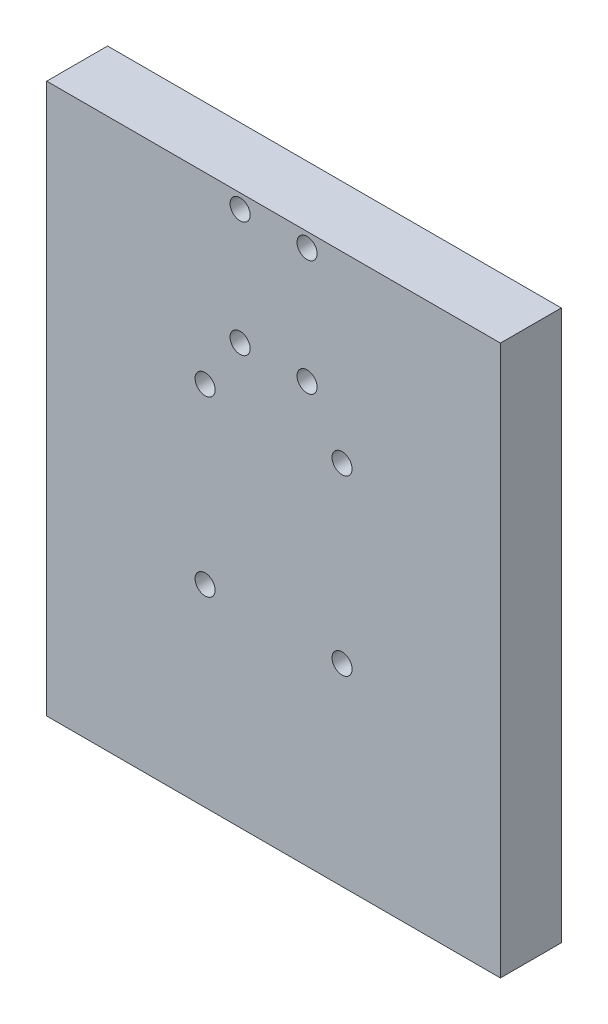
ISO-10303-21;
HEADER;
FILE_DESCRIPTION(('STEP AP214'),'2;1');
FILE_NAME('part.step','',(''),(''),'','','');
FILE_SCHEMA(('AUTOMOTIVE_DESIGN { 1 0 10303 214 1 1 1 1 }'));
ENDSEC;
DATA;
#1=APPLICATION_CONTEXT('core data for automotive mechanical design processes');
#2=APPLICATION_PROTOCOL_DEFINITION('international standard','automotive_design',2000,#1);
#3=PRODUCT_CONTEXT('',#1,'mechanical');
#4=PRODUCT('Part','Part','',(#3));
#5=PRODUCT_RELATED_PRODUCT_CATEGORY('part','',(#4));
#6=PRODUCT_DEFINITION_FORMATION('','',#4);
#7=PRODUCT_DEFINITION_CONTEXT('part definition',#1,'design');
#8=PRODUCT_DEFINITION('design','',#6,#7);
#9=PRODUCT_DEFINITION_SHAPE('','',#8);
#10=(LENGTH_UNIT() NAMED_UNIT(*) SI_UNIT(.MILLI.,.METRE.));
#11=(NAMED_UNIT(*) PLANE_ANGLE_UNIT() SI_UNIT($,.RADIAN.));
#12=(NAMED_UNIT(*) SI_UNIT($,.STERADIAN.) SOLID_ANGLE_UNIT());
#13=UNCERTAINTY_MEASURE_WITH_UNIT(LENGTH_MEASURE(1.E-05),#10,'distance_accuracy_value','');
#14=(GEOMETRIC_REPRESENTATION_CONTEXT(3) GLOBAL_UNCERTAINTY_ASSIGNED_CONTEXT((#13)) GLOBAL_UNIT_ASSIGNED_CONTEXT((#10,
#11,#12)) REPRESENTATION_CONTEXT('',''));
#15=CARTESIAN_POINT('',(0.,0.,0.));
#16=DIRECTION('',(0.,0.,1.));
#17=DIRECTION('',(1.,0.,0.));
#18=AXIS2_PLACEMENT_3D('',#15,#16,#17);
#19=CARTESIAN_POINT('',(-201.538794114779,2367.24856685212,20.));
#20=DIRECTION('',(1.,0.,0.));
#21=DIRECTION('',(0.,0.,-1.));
#22=AXIS2_PLACEMENT_3D('',#19,#20,#21);
#23=PLANE('',#22);
#24=DIRECTION('',(0.,-1.,0.));
#25=VECTOR('',#24,1.);
#26=CARTESIAN_POINT('',(-201.538794114779,2367.24856685212,0.));
#27=LINE('',#26,#25);
#28=CARTESIAN_POINT('',(-201.538794114779,2367.24856685212,0.));
#29=VERTEX_POINT('',#28);
#30=CARTESIAN_POINT('',(-201.538794114779,2186.54856685219,0.));
#31=VERTEX_POINT('',#30);
#32=EDGE_CURVE('E99',#29,#31,#27,.T.);
#33=ORIENTED_EDGE('',*,*,#32,.T.);
#34=DIRECTION('',(0.,0.,-1.));
#35=VECTOR('',#34,1.);
#36=CARTESIAN_POINT('',(-201.538794114779,2186.54856685219,20.));
#37=LINE('',#36,#35);
#38=CARTESIAN_POINT('',(-201.538794114779,2186.54856685219,20.));
#39=VERTEX_POINT('',#38);
#40=EDGE_CURVE('E11',#39,#31,#37,.T.);
#41=ORIENTED_EDGE('',*,*,#40,.F.);
#42=DIRECTION('',(0.,-1.,0.));
#43=VECTOR('',#42,1.);
#44=CARTESIAN_POINT('',(-201.538794114779,2367.24856685212,20.));
#45=LINE('',#44,#43);
#46=CARTESIAN_POINT('',(-201.538794114779,2367.24856685212,20.));
#47=VERTEX_POINT('',#46);
#48=EDGE_CURVE('E86',#47,#39,#45,.T.);
#49=ORIENTED_EDGE('',*,*,#48,.F.);
#50=DIRECTION('',(0.,0.,-1.));
#51=VECTOR('',#50,1.);
#52=CARTESIAN_POINT('',(-201.538794114779,2367.24856685212,20.));
#53=LINE('',#52,#51);
#54=EDGE_CURVE('E95',#47,#29,#53,.T.);
#55=ORIENTED_EDGE('',*,*,#54,.T.);
#56=EDGE_LOOP('',(#33,#41,#49,#55));
#57=FACE_BOUND('',#56,.T.);
#58=ADVANCED_FACE('F33',(#57),#23,.F.);
#59=CARTESIAN_POINT('',(-201.538794114779,2186.54856685219,20.));
#60=DIRECTION('',(0.,1.,0.));
#61=DIRECTION('',(0.,0.,1.));
#62=AXIS2_PLACEMENT_3D('',#59,#60,#61);
#63=PLANE('',#62);
#64=DIRECTION('',(1.,0.,0.));
#65=VECTOR('',#64,1.);
#66=CARTESIAN_POINT('',(-201.538794114779,2186.54856685219,0.));
#67=LINE('',#66,#65);
#68=CARTESIAN_POINT('',(-52.4383435202714,2186.54856685219,0.));
#69=VERTEX_POINT('',#68);
#70=EDGE_CURVE('E90',#31,#69,#67,.T.);
#71=ORIENTED_EDGE('',*,*,#70,.T.);
#72=DIRECTION('',(0.,0.,-1.));
#73=VECTOR('',#72,1.);
#74=CARTESIAN_POINT('',(-52.4383435202714,2186.54856685219,20.));
#75=LINE('',#74,#73);
#76=CARTESIAN_POINT('',(-52.4383435202714,2186.54856685219,20.));
#77=VERTEX_POINT('',#76);
#78=EDGE_CURVE('E42',#77,#69,#75,.T.);
#79=ORIENTED_EDGE('',*,*,#78,.F.);
#80=DIRECTION('',(1.,0.,0.));
#81=VECTOR('',#80,1.);
#82=CARTESIAN_POINT('',(-201.538794114779,2186.54856685219,20.));
#83=LINE('',#82,#81);
#84=EDGE_CURVE('E81',#39,#77,#83,.T.);
#85=ORIENTED_EDGE('',*,*,#84,.F.);
#86=ORIENTED_EDGE('',*,*,#40,.T.);
#87=EDGE_LOOP('',(#71,#79,#85,#86));
#88=FACE_BOUND('',#87,.T.);
#89=ADVANCED_FACE('F89',(#88),#63,.F.);
#90=CARTESIAN_POINT('',(-52.4383435202714,2367.24856685212,20.));
#91=DIRECTION('',(-1.,0.,0.));
#92=DIRECTION('',(0.,0.,1.));
#93=AXIS2_PLACEMENT_3D('',#90,#91,#92);
#94=PLANE('',#93);
#95=DIRECTION('',(0.,1.,0.));
#96=VECTOR('',#95,1.);
#97=CARTESIAN_POINT('',(-52.4383435202714,2367.24856685212,0.));
#98=LINE('',#97,#96);
#99=CARTESIAN_POINT('',(-52.4383435202714,2367.24856685212,0.));
#100=VERTEX_POINT('',#99);
#101=EDGE_CURVE('E68',#69,#100,#98,.T.);
#102=ORIENTED_EDGE('',*,*,#101,.T.);
#103=DIRECTION('',(0.,0.,-1.));
#104=VECTOR('',#103,1.);
#105=CARTESIAN_POINT('',(-52.4383435202714,2367.24856685212,20.));
#106=LINE('',#105,#104);
#107=CARTESIAN_POINT('',(-52.4383435202714,2367.24856685212,20.));
#108=VERTEX_POINT('',#107);
#109=EDGE_CURVE('E91',#108,#100,#106,.T.);
#110=ORIENTED_EDGE('',*,*,#109,.F.);
#111=DIRECTION('',(0.,1.,0.));
#112=VECTOR('',#111,1.);
#113=CARTESIAN_POINT('',(-52.4383435202714,2367.24856685212,20.));
#114=LINE('',#113,#112);
#115=EDGE_CURVE('E84',#77,#108,#114,.T.);
#116=ORIENTED_EDGE('',*,*,#115,.F.);
#117=ORIENTED_EDGE('',*,*,#78,.T.);
#118=EDGE_LOOP('',(#102,#110,#116,#117));
#119=FACE_BOUND('',#118,.T.);
#120=ADVANCED_FACE('F93',(#119),#94,.F.);
#121=CARTESIAN_POINT('',(-52.4383435202714,2367.24856685212,20.));
#122=DIRECTION('',(0.,-1.,0.));
#123=DIRECTION('',(0.,0.,-1.));
#124=AXIS2_PLACEMENT_3D('',#121,#122,#123);
#125=PLANE('',#124);
#126=DIRECTION('',(-1.,0.,0.));
#127=VECTOR('',#126,1.);
#128=CARTESIAN_POINT('',(-52.4383435202714,2367.24856685212,0.));
#129=LINE('',#128,#127);
#130=EDGE_CURVE('E74',#100,#29,#129,.T.);
#131=ORIENTED_EDGE('',*,*,#130,.T.);
#132=ORIENTED_EDGE('',*,*,#54,.F.);
#133=DIRECTION('',(-1.,0.,0.));
#134=VECTOR('',#133,1.);
#135=CARTESIAN_POINT('',(-52.4383435202714,2367.24856685212,20.));
#136=LINE('',#135,#134);
#137=EDGE_CURVE('E51',#108,#47,#136,.T.);
#138=ORIENTED_EDGE('',*,*,#137,.F.);
#139=ORIENTED_EDGE('',*,*,#109,.T.);
#140=EDGE_LOOP('',(#131,#132,#138,#139));
#141=FACE_BOUND('',#140,.T.);
#142=ADVANCED_FACE('F163',(#141),#125,.F.);
#143=CARTESIAN_POINT('',(0.,0.,20.));
#144=DIRECTION('',(0.,0.,1.));
#145=DIRECTION('',(1.,0.,0.));
#146=AXIS2_PLACEMENT_3D('',#143,#144,#145);
#147=PLANE('',#146);
#148=CARTESIAN_POINT('',(-149.488568816633,2307.04856685224,20.));
#149=DIRECTION('',(0.,0.,1.));
#150=DIRECTION('',(1.,0.,0.));
#151=AXIS2_PLACEMENT_3D('',#148,#149,#150);
#152=CIRCLE('',#151,3.3);
#153=CARTESIAN_POINT('',(-146.188568816633,2307.04856685224,20.));
#154=VERTEX_POINT('',#153);
#155=EDGE_CURVE('E273',#154,#154,#152,.T.);
#156=ORIENTED_EDGE('',*,*,#155,.F.);
#157=EDGE_LOOP('',(#156));
#158=FACE_BOUND('',#157,.T.);
#159=CARTESIAN_POINT('',(-104.488568816633,2307.04856685222,20.));
#160=DIRECTION('',(0.,0.,1.));
#161=DIRECTION('',(1.,0.,0.));
#162=AXIS2_PLACEMENT_3D('',#159,#160,#161);
#163=CIRCLE('',#162,3.29999999999998);
#164=CARTESIAN_POINT('',(-101.188568816633,2307.04856685222,20.));
#165=VERTEX_POINT('',#164);
#166=EDGE_CURVE('E277',#165,#165,#163,.T.);
#167=ORIENTED_EDGE('',*,*,#166,.F.);
#168=EDGE_LOOP('',(#167));
#169=FACE_BOUND('',#168,.T.);
#170=CARTESIAN_POINT('',(-104.488568816659,2250.04856685222,20.));
#171=DIRECTION('',(0.,0.,1.));
#172=DIRECTION('',(1.,0.,0.));
#173=AXIS2_PLACEMENT_3D('',#170,#171,#172);
#174=CIRCLE('',#173,3.29999999999998);
#175=CARTESIAN_POINT('',(-101.188568816659,2250.04856685222,20.));
#176=VERTEX_POINT('',#175);
#177=EDGE_CURVE('E286',#176,#176,#174,.T.);
#178=ORIENTED_EDGE('',*,*,#177,.F.);
#179=EDGE_LOOP('',(#178));
#180=FACE_BOUND('',#179,.T.);
#181=CARTESIAN_POINT('',(-149.488568816659,2250.04856685224,20.));
#182=DIRECTION('',(0.,0.,1.));
#183=DIRECTION('',(1.,0.,0.));
#184=AXIS2_PLACEMENT_3D('',#181,#182,#183);
#185=CIRCLE('',#184,3.3);
#186=CARTESIAN_POINT('',(-146.188568816659,2250.04856685224,20.));
#187=VERTEX_POINT('',#186);
#188=EDGE_CURVE('E121',#187,#187,#185,.T.);
#189=ORIENTED_EDGE('',*,*,#188,.F.);
#190=EDGE_LOOP('',(#189));
#191=FACE_BOUND('',#190,.T.);
#192=CARTESIAN_POINT('',(-137.988568817517,2362.54856685212,20.));
#193=DIRECTION('',(0.,0.,1.));
#194=DIRECTION('',(1.,0.,0.));
#195=AXIS2_PLACEMENT_3D('',#192,#193,#194);
#196=CIRCLE('',#195,3.3);
#197=CARTESIAN_POINT('',(-134.688568817517,2362.54856685212,20.));
#198=VERTEX_POINT('',#197);
#199=EDGE_CURVE('E110',#198,#198,#196,.T.);
#200=ORIENTED_EDGE('',*,*,#199,.F.);
#201=EDGE_LOOP('',(#200));
#202=FACE_BOUND('',#201,.T.);
#203=CARTESIAN_POINT('',(-137.988568817518,2324.54856685212,20.));
#204=DIRECTION('',(0.,0.,1.));
#205=DIRECTION('',(1.,0.,0.));
#206=AXIS2_PLACEMENT_3D('',#203,#204,#205);
#207=CIRCLE('',#206,3.3);
#208=CARTESIAN_POINT('',(-134.688568817518,2324.54856685212,20.));
#209=VERTEX_POINT('',#208);
#210=EDGE_CURVE('E109',#209,#209,#207,.T.);
#211=ORIENTED_EDGE('',*,*,#210,.F.);
#212=EDGE_LOOP('',(#211));
#213=FACE_BOUND('',#212,.T.);
#214=CARTESIAN_POINT('',(-115.988568817518,2324.54856685212,20.));
#215=DIRECTION('',(0.,0.,1.));
#216=DIRECTION('',(1.,0.,0.));
#217=AXIS2_PLACEMENT_3D('',#214,#215,#216);
#218=CIRCLE('',#217,3.29999999999998);
#219=CARTESIAN_POINT('',(-112.688568817518,2324.54856685212,20.));
#220=VERTEX_POINT('',#219);
#221=EDGE_CURVE('E127',#220,#220,#218,.T.);
#222=ORIENTED_EDGE('',*,*,#221,.F.);
#223=EDGE_LOOP('',(#222));
#224=FACE_BOUND('',#223,.T.);
#225=CARTESIAN_POINT('',(-115.988568817518,2362.54856685212,20.));
#226=DIRECTION('',(0.,0.,1.));
#227=DIRECTION('',(1.,0.,0.));
#228=AXIS2_PLACEMENT_3D('',#225,#226,#227);
#229=CIRCLE('',#228,3.29999999999998);
#230=CARTESIAN_POINT('',(-112.688568817518,2362.54856685212,20.));
#231=VERTEX_POINT('',#230);
#232=EDGE_CURVE('E133',#231,#231,#229,.T.);
#233=ORIENTED_EDGE('',*,*,#232,.F.);
#234=EDGE_LOOP('',(#233));
#235=FACE_BOUND('',#234,.T.);
#236=ORIENTED_EDGE('',*,*,#48,.T.);
#237=ORIENTED_EDGE('',*,*,#84,.T.);
#238=ORIENTED_EDGE('',*,*,#115,.T.);
#239=ORIENTED_EDGE('',*,*,#137,.T.);
#240=EDGE_LOOP('',(#236,#237,#238,#239));
#241=FACE_BOUND('',#240,.T.);
#242=ADVANCED_FACE('F82',(#158,#169,#180,#191,#202,#213,#224,#235,#241),#147,.T.);
#243=CARTESIAN_POINT('',(0.,0.,0.));
#244=DIRECTION('',(0.,0.,1.));
#245=DIRECTION('',(1.,0.,0.));
#246=AXIS2_PLACEMENT_3D('',#243,#244,#245);
#247=PLANE('',#246);
#248=CARTESIAN_POINT('',(-149.488568816633,2307.04856685224,0.));
#249=DIRECTION('',(0.,0.,1.));
#250=DIRECTION('',(1.,0.,0.));
#251=AXIS2_PLACEMENT_3D('',#248,#249,#250);
#252=CIRCLE('',#251,3.29999999999998);
#253=CARTESIAN_POINT('',(-146.188568816633,2307.04856685224,0.));
#254=VERTEX_POINT('',#253);
#255=EDGE_CURVE('E276',#254,#254,#252,.T.);
#256=ORIENTED_EDGE('',*,*,#255,.T.);
#257=EDGE_LOOP('',(#256));
#258=FACE_BOUND('',#257,.T.);
#259=CARTESIAN_POINT('',(-104.488568816633,2307.04856685222,0.));
#260=DIRECTION('',(0.,0.,1.));
#261=DIRECTION('',(1.,0.,0.));
#262=AXIS2_PLACEMENT_3D('',#259,#260,#261);
#263=CIRCLE('',#262,3.29999999999998);
#264=CARTESIAN_POINT('',(-101.188568816633,2307.04856685222,0.));
#265=VERTEX_POINT('',#264);
#266=EDGE_CURVE('E280',#265,#265,#263,.T.);
#267=ORIENTED_EDGE('',*,*,#266,.T.);
#268=EDGE_LOOP('',(#267));
#269=FACE_BOUND('',#268,.T.);
#270=CARTESIAN_POINT('',(-104.488568816659,2250.04856685222,0.));
#271=DIRECTION('',(0.,0.,1.));
#272=DIRECTION('',(1.,0.,0.));
#273=AXIS2_PLACEMENT_3D('',#270,#271,#272);
#274=CIRCLE('',#273,3.29999999999998);
#275=CARTESIAN_POINT('',(-101.188568816659,2250.04856685222,0.));
#276=VERTEX_POINT('',#275);
#277=EDGE_CURVE('E288',#276,#276,#274,.T.);
#278=ORIENTED_EDGE('',*,*,#277,.T.);
#279=EDGE_LOOP('',(#278));
#280=FACE_BOUND('',#279,.T.);
#281=CARTESIAN_POINT('',(-149.488568816659,2250.04856685224,0.));
#282=DIRECTION('',(0.,0.,1.));
#283=DIRECTION('',(1.,0.,0.));
#284=AXIS2_PLACEMENT_3D('',#281,#282,#283);
#285=CIRCLE('',#284,3.29999999999998);
#286=CARTESIAN_POINT('',(-146.188568816659,2250.04856685224,0.));
#287=VERTEX_POINT('',#286);
#288=EDGE_CURVE('E36',#287,#287,#285,.T.);
#289=ORIENTED_EDGE('',*,*,#288,.T.);
#290=EDGE_LOOP('',(#289));
#291=FACE_BOUND('',#290,.T.);
#292=CARTESIAN_POINT('',(-137.988568817517,2362.54856685212,0.));
#293=DIRECTION('',(0.,0.,1.));
#294=DIRECTION('',(1.,0.,0.));
#295=AXIS2_PLACEMENT_3D('',#292,#293,#294);
#296=CIRCLE('',#295,3.3);
#297=CARTESIAN_POINT('',(-134.688568817517,2362.54856685212,0.));
#298=VERTEX_POINT('',#297);
#299=EDGE_CURVE('E107',#298,#298,#296,.T.);
#300=ORIENTED_EDGE('',*,*,#299,.T.);
#301=EDGE_LOOP('',(#300));
#302=FACE_BOUND('',#301,.T.);
#303=CARTESIAN_POINT('',(-137.988568817518,2324.54856685212,0.));
#304=DIRECTION('',(0.,0.,1.));
#305=DIRECTION('',(1.,0.,0.));
#306=AXIS2_PLACEMENT_3D('',#303,#304,#305);
#307=CIRCLE('',#306,3.3);
#308=CARTESIAN_POINT('',(-134.688568817518,2324.54856685212,0.));
#309=VERTEX_POINT('',#308);
#310=EDGE_CURVE('E114',#309,#309,#307,.T.);
#311=ORIENTED_EDGE('',*,*,#310,.T.);
#312=EDGE_LOOP('',(#311));
#313=FACE_BOUND('',#312,.T.);
#314=CARTESIAN_POINT('',(-115.988568817518,2324.54856685212,0.));
#315=DIRECTION('',(0.,0.,1.));
#316=DIRECTION('',(1.,0.,0.));
#317=AXIS2_PLACEMENT_3D('',#314,#315,#316);
#318=CIRCLE('',#317,3.29999999999998);
#319=CARTESIAN_POINT('',(-112.688568817518,2324.54856685212,0.));
#320=VERTEX_POINT('',#319);
#321=EDGE_CURVE('E130',#320,#320,#318,.T.);
#322=ORIENTED_EDGE('',*,*,#321,.T.);
#323=EDGE_LOOP('',(#322));
#324=FACE_BOUND('',#323,.T.);
#325=CARTESIAN_POINT('',(-115.988568817518,2362.54856685212,0.));
#326=DIRECTION('',(0.,0.,1.));
#327=DIRECTION('',(1.,0.,0.));
#328=AXIS2_PLACEMENT_3D('',#325,#326,#327);
#329=CIRCLE('',#328,3.29999999999998);
#330=CARTESIAN_POINT('',(-112.688568817518,2362.54856685212,0.));
#331=VERTEX_POINT('',#330);
#332=EDGE_CURVE('E102',#331,#331,#329,.T.);
#333=ORIENTED_EDGE('',*,*,#332,.T.);
#334=EDGE_LOOP('',(#333));
#335=FACE_BOUND('',#334,.T.);
#336=ORIENTED_EDGE('',*,*,#32,.F.);
#337=ORIENTED_EDGE('',*,*,#130,.F.);
#338=ORIENTED_EDGE('',*,*,#101,.F.);
#339=ORIENTED_EDGE('',*,*,#70,.F.);
#340=EDGE_LOOP('',(#336,#337,#338,#339));
#341=FACE_BOUND('',#340,.T.);
#342=ADVANCED_FACE('F139',(#258,#269,#280,#291,#302,#313,#324,#335,#341),#247,.F.);
#343=CARTESIAN_POINT('',(-115.988568817518,2362.54856685212,20.));
#344=DIRECTION('',(0.,0.,1.));
#345=DIRECTION('',(1.,0.,0.));
#346=AXIS2_PLACEMENT_3D('',#343,#344,#345);
#347=CYLINDRICAL_SURFACE('',#346,3.29999999999998);
#348=ORIENTED_EDGE('',*,*,#232,.T.);
#349=EDGE_LOOP('',(#348));
#350=FACE_BOUND('',#349,.T.);
#351=ORIENTED_EDGE('',*,*,#332,.F.);
#352=EDGE_LOOP('',(#351));
#353=FACE_BOUND('',#352,.T.);
#354=ADVANCED_FACE('F142',(#350,#353),#347,.F.);
#355=CARTESIAN_POINT('',(-115.988568817518,2324.54856685212,20.));
#356=DIRECTION('',(0.,0.,1.));
#357=DIRECTION('',(1.,0.,0.));
#358=AXIS2_PLACEMENT_3D('',#355,#356,#357);
#359=CYLINDRICAL_SURFACE('',#358,3.29999999999998);
#360=ORIENTED_EDGE('',*,*,#221,.T.);
#361=EDGE_LOOP('',(#360));
#362=FACE_BOUND('',#361,.T.);
#363=ORIENTED_EDGE('',*,*,#321,.F.);
#364=EDGE_LOOP('',(#363));
#365=FACE_BOUND('',#364,.T.);
#366=ADVANCED_FACE('F144',(#362,#365),#359,.F.);
#367=CARTESIAN_POINT('',(-137.988568817518,2324.54856685212,20.));
#368=DIRECTION('',(0.,0.,1.));
#369=DIRECTION('',(1.,0.,0.));
#370=AXIS2_PLACEMENT_3D('',#367,#368,#369);
#371=CYLINDRICAL_SURFACE('',#370,3.3);
#372=ORIENTED_EDGE('',*,*,#210,.T.);
#373=EDGE_LOOP('',(#372));
#374=FACE_BOUND('',#373,.T.);
#375=ORIENTED_EDGE('',*,*,#310,.F.);
#376=EDGE_LOOP('',(#375));
#377=FACE_BOUND('',#376,.T.);
#378=ADVANCED_FACE('F151',(#374,#377),#371,.F.);
#379=CARTESIAN_POINT('',(-137.988568817517,2362.54856685212,20.));
#380=DIRECTION('',(0.,0.,1.));
#381=DIRECTION('',(1.,0.,0.));
#382=AXIS2_PLACEMENT_3D('',#379,#380,#381);
#383=CYLINDRICAL_SURFACE('',#382,3.3);
#384=ORIENTED_EDGE('',*,*,#199,.T.);
#385=EDGE_LOOP('',(#384));
#386=FACE_BOUND('',#385,.T.);
#387=ORIENTED_EDGE('',*,*,#299,.F.);
#388=EDGE_LOOP('',(#387));
#389=FACE_BOUND('',#388,.T.);
#390=ADVANCED_FACE('F217',(#386,#389),#383,.F.);
#391=CARTESIAN_POINT('',(-149.488568816659,2250.04856685224,20.));
#392=DIRECTION('',(0.,0.,1.));
#393=DIRECTION('',(1.,0.,0.));
#394=AXIS2_PLACEMENT_3D('',#391,#392,#393);
#395=CYLINDRICAL_SURFACE('',#394,3.29999999999998);
#396=ORIENTED_EDGE('',*,*,#188,.T.);
#397=EDGE_LOOP('',(#396));
#398=FACE_BOUND('',#397,.T.);
#399=ORIENTED_EDGE('',*,*,#288,.F.);
#400=EDGE_LOOP('',(#399));
#401=FACE_BOUND('',#400,.T.);
#402=ADVANCED_FACE('F226',(#398,#401),#395,.F.);
#403=CARTESIAN_POINT('',(-104.488568816659,2250.04856685222,20.));
#404=DIRECTION('',(0.,0.,1.));
#405=DIRECTION('',(1.,0.,0.));
#406=AXIS2_PLACEMENT_3D('',#403,#404,#405);
#407=CYLINDRICAL_SURFACE('',#406,3.29999999999998);
#408=ORIENTED_EDGE('',*,*,#177,.T.);
#409=EDGE_LOOP('',(#408));
#410=FACE_BOUND('',#409,.T.);
#411=ORIENTED_EDGE('',*,*,#277,.F.);
#412=EDGE_LOOP('',(#411));
#413=FACE_BOUND('',#412,.T.);
#414=ADVANCED_FACE('F234',(#410,#413),#407,.F.);
#415=CARTESIAN_POINT('',(-104.488568816633,2307.04856685222,20.));
#416=DIRECTION('',(0.,0.,1.));
#417=DIRECTION('',(1.,0.,0.));
#418=AXIS2_PLACEMENT_3D('',#415,#416,#417);
#419=CYLINDRICAL_SURFACE('',#418,3.29999999999998);
#420=ORIENTED_EDGE('',*,*,#166,.T.);
#421=EDGE_LOOP('',(#420));
#422=FACE_BOUND('',#421,.T.);
#423=ORIENTED_EDGE('',*,*,#266,.F.);
#424=EDGE_LOOP('',(#423));
#425=FACE_BOUND('',#424,.T.);
#426=ADVANCED_FACE('F243',(#422,#425),#419,.F.);
#427=CARTESIAN_POINT('',(-149.488568816633,2307.04856685224,20.));
#428=DIRECTION('',(0.,0.,1.));
#429=DIRECTION('',(1.,0.,0.));
#430=AXIS2_PLACEMENT_3D('',#427,#428,#429);
#431=CYLINDRICAL_SURFACE('',#430,3.29999999999998);
#432=ORIENTED_EDGE('',*,*,#155,.T.);
#433=EDGE_LOOP('',(#432));
#434=FACE_BOUND('',#433,.T.);
#435=ORIENTED_EDGE('',*,*,#255,.F.);
#436=EDGE_LOOP('',(#435));
#437=FACE_BOUND('',#436,.T.);
#438=ADVANCED_FACE('F252',(#434,#437),#431,.F.);
#439=CLOSED_SHELL('',(#58,#89,#120,#142,#242,#342,#354,#366,#378,#390,#402,#414,#426,#438));
#440=MANIFOLD_SOLID_BREP('B2',#439);
#441=ADVANCED_BREP_SHAPE_REPRESENTATION('',(#18,#440),#14);
#442=SHAPE_DEFINITION_REPRESENTATION(#9,#441);
ENDSEC;
END-ISO-10303-21;
